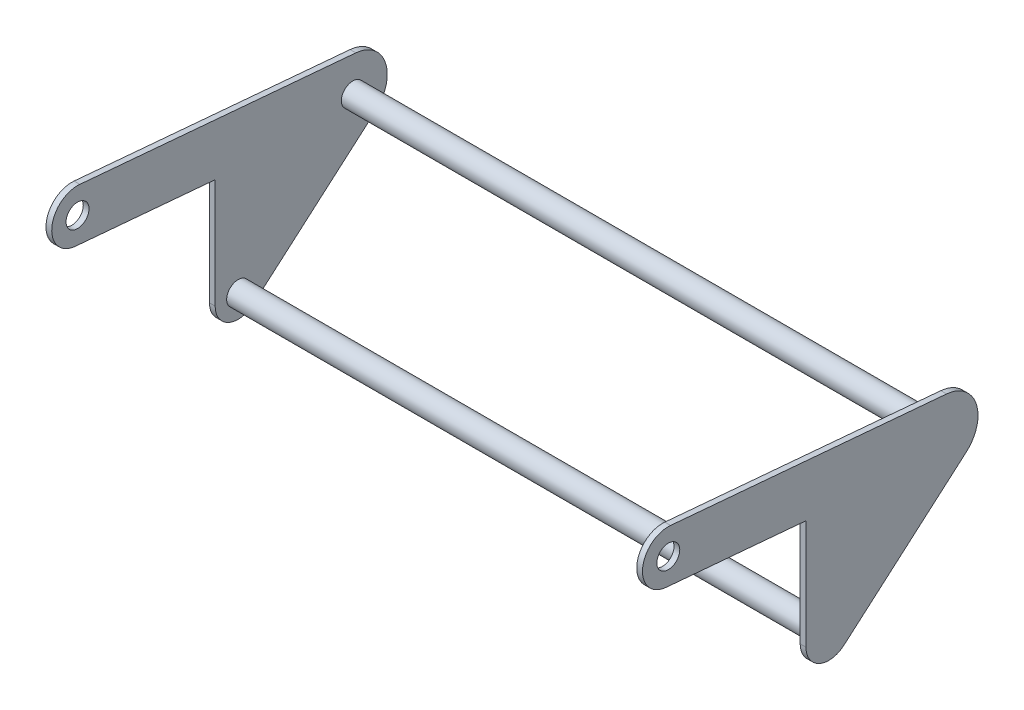
ISO-10303-21;
HEADER;
FILE_DESCRIPTION(('STEP AP214'),'2;1');
FILE_NAME('part.step','',(''),(''),'','','');
FILE_SCHEMA(('AUTOMOTIVE_DESIGN { 1 0 10303 214 1 1 1 1 }'));
ENDSEC;
DATA;
#1=APPLICATION_CONTEXT('core data for automotive mechanical design processes');
#2=APPLICATION_PROTOCOL_DEFINITION('international standard','automotive_design',2000,#1);
#3=PRODUCT_CONTEXT('',#1,'mechanical');
#4=PRODUCT('Part','Part','',(#3));
#5=PRODUCT_RELATED_PRODUCT_CATEGORY('part','',(#4));
#6=PRODUCT_DEFINITION_FORMATION('','',#4);
#7=PRODUCT_DEFINITION_CONTEXT('part definition',#1,'design');
#8=PRODUCT_DEFINITION('design','',#6,#7);
#9=PRODUCT_DEFINITION_SHAPE('','',#8);
#10=(LENGTH_UNIT() NAMED_UNIT(*) SI_UNIT(.MILLI.,.METRE.));
#11=(NAMED_UNIT(*) PLANE_ANGLE_UNIT() SI_UNIT($,.RADIAN.));
#12=(NAMED_UNIT(*) SI_UNIT($,.STERADIAN.) SOLID_ANGLE_UNIT());
#13=UNCERTAINTY_MEASURE_WITH_UNIT(LENGTH_MEASURE(1.E-05),#10,'distance_accuracy_value','');
#14=(GEOMETRIC_REPRESENTATION_CONTEXT(3) GLOBAL_UNCERTAINTY_ASSIGNED_CONTEXT((#13)) GLOBAL_UNIT_ASSIGNED_CONTEXT((#10,
#11,#12)) REPRESENTATION_CONTEXT('',''));
#15=CARTESIAN_POINT('',(0.,0.,0.));
#16=DIRECTION('',(0.,0.,1.));
#17=DIRECTION('',(1.,0.,0.));
#18=AXIS2_PLACEMENT_3D('',#15,#16,#17);
#19=CARTESIAN_POINT('',(660.4,121.210504416149,25.4));
#20=DIRECTION('',(0.,0.,-1.));
#21=DIRECTION('',(0.,1.,0.));
#22=AXIS2_PLACEMENT_3D('',#19,#20,#21);
#23=PLANE('',#22);
#24=DIRECTION('',(-1.,0.,0.));
#25=VECTOR('',#24,1.);
#26=CARTESIAN_POINT('',(660.4,121.210504416149,25.4));
#27=LINE('',#26,#25);
#28=CARTESIAN_POINT('',(660.4,121.210504416149,25.4));
#29=VERTEX_POINT('',#28);
#30=CARTESIAN_POINT('',(654.05,121.210504416149,25.4));
#31=VERTEX_POINT('',#30);
#32=EDGE_CURVE('E250',#29,#31,#27,.T.);
#33=ORIENTED_EDGE('',*,*,#32,.T.);
#34=DIRECTION('',(0.,-1.,0.));
#35=VECTOR('',#34,1.);
#36=CARTESIAN_POINT('',(654.05,121.210504416149,25.4));
#37=LINE('',#36,#35);
#38=CARTESIAN_POINT('',(654.05,0.,25.4));
#39=VERTEX_POINT('',#38);
#40=EDGE_CURVE('E247',#31,#39,#37,.T.);
#41=ORIENTED_EDGE('',*,*,#40,.T.);
#42=DIRECTION('',(-1.,0.,0.));
#43=VECTOR('',#42,1.);
#44=CARTESIAN_POINT('',(660.4,0.,25.4));
#45=LINE('',#44,#43);
#46=CARTESIAN_POINT('',(660.4,0.,25.4));
#47=VERTEX_POINT('',#46);
#48=EDGE_CURVE('E238',#47,#39,#45,.T.);
#49=ORIENTED_EDGE('',*,*,#48,.F.);
#50=DIRECTION('',(0.,-1.,0.));
#51=VECTOR('',#50,1.);
#52=CARTESIAN_POINT('',(660.4,121.210504416149,25.4));
#53=LINE('',#52,#51);
#54=EDGE_CURVE('E226',#29,#47,#53,.T.);
#55=ORIENTED_EDGE('',*,*,#54,.F.);
#56=EDGE_LOOP('',(#33,#41,#49,#55));
#57=FACE_BOUND('',#56,.T.);
#58=ADVANCED_FACE('F49',(#57),#23,.F.);
#59=CARTESIAN_POINT('',(660.4,-19.1855546941757,-16.6455546941757));
#60=DIRECTION('',(0.,0.755336798983294,0.655336798983294));
#61=DIRECTION('',(0.,-0.655336798983294,0.755336798983294));
#62=AXIS2_PLACEMENT_3D('',#59,#60,#61);
#63=PLANE('',#62);
#64=DIRECTION('',(-1.,0.,0.));
#65=VECTOR('',#64,1.);
#66=CARTESIAN_POINT('',(660.4,-19.1855546941757,-16.6455546941757));
#67=LINE('',#66,#65);
#68=CARTESIAN_POINT('',(660.4,-19.1855546941757,-16.6455546941757));
#69=VERTEX_POINT('',#68);
#70=CARTESIAN_POINT('',(654.05,-19.1855546941757,-16.6455546941757));
#71=VERTEX_POINT('',#70);
#72=EDGE_CURVE('E235',#69,#71,#67,.T.);
#73=ORIENTED_EDGE('',*,*,#72,.T.);
#74=DIRECTION('',(0.,0.655336798983294,-0.755336798983294));
#75=VECTOR('',#74,1.);
#76=CARTESIAN_POINT('',(654.05,-19.1855546941757,-16.6455546941757));
#77=LINE('',#76,#75);
#78=CARTESIAN_POINT('',(654.05,98.2216679587365,-151.968332041264));
#79=VERTEX_POINT('',#78);
#80=EDGE_CURVE('E230',#71,#79,#77,.T.);
#81=ORIENTED_EDGE('',*,*,#80,.T.);
#82=DIRECTION('',(-1.,0.,0.));
#83=VECTOR('',#82,1.);
#84=CARTESIAN_POINT('',(660.4,98.2216679587365,-151.968332041264));
#85=LINE('',#84,#83);
#86=CARTESIAN_POINT('',(660.4,98.2216679587365,-151.968332041264));
#87=VERTEX_POINT('',#86);
#88=EDGE_CURVE('E229',#87,#79,#85,.T.);
#89=ORIENTED_EDGE('',*,*,#88,.F.);
#90=DIRECTION('',(0.,0.655336798983294,-0.755336798983294));
#91=VECTOR('',#90,1.);
#92=CARTESIAN_POINT('',(660.4,-19.1855546941757,-16.6455546941757));
#93=LINE('',#92,#91);
#94=EDGE_CURVE('E221',#69,#87,#93,.T.);
#95=ORIENTED_EDGE('',*,*,#94,.F.);
#96=EDGE_LOOP('',(#73,#81,#89,#95));
#97=FACE_BOUND('',#96,.T.);
#98=ADVANCED_FACE('F298',(#97),#63,.F.);
#99=CARTESIAN_POINT('',(660.4,164.955017997296,-130.320633798686));
#100=DIRECTION('',(0.,-0.996194698091746,0.087155742747654));
#101=DIRECTION('',(0.,-0.087155742747654,-0.996194698091746));
#102=AXIS2_PLACEMENT_3D('',#99,#100,#101);
#103=PLANE('',#102);
#104=DIRECTION('',(-1.,0.,0.));
#105=VECTOR('',#104,1.);
#106=CARTESIAN_POINT('',(660.4,164.955017997296,-130.320633798686));
#107=LINE('',#106,#105);
#108=CARTESIAN_POINT('',(660.4,164.955017997296,-130.320633798686));
#109=VERTEX_POINT('',#108);
#110=CARTESIAN_POINT('',(654.05,164.955017997296,-130.320633798686));
#111=VERTEX_POINT('',#110);
#112=EDGE_CURVE('E234',#109,#111,#107,.T.);
#113=ORIENTED_EDGE('',*,*,#112,.T.);
#114=DIRECTION('',(0.,0.087155742747654,0.996194698091746));
#115=VECTOR('',#114,1.);
#116=CARTESIAN_POINT('',(654.05,164.955017997296,-130.320633798686));
#117=LINE('',#116,#115);
#118=CARTESIAN_POINT('',(654.05,191.694192093272,175.309524650986));
#119=VERTEX_POINT('',#118);
#120=EDGE_CURVE('E242',#111,#119,#117,.T.);
#121=ORIENTED_EDGE('',*,*,#120,.T.);
#122=DIRECTION('',(-1.,0.,0.));
#123=VECTOR('',#122,1.);
#124=CARTESIAN_POINT('',(660.4,191.694192093272,175.309524650986));
#125=LINE('',#124,#123);
#126=CARTESIAN_POINT('',(660.4,191.694192093272,175.309524650986));
#127=VERTEX_POINT('',#126);
#128=EDGE_CURVE('E254',#127,#119,#125,.T.);
#129=ORIENTED_EDGE('',*,*,#128,.F.);
#130=DIRECTION('',(0.,0.0871557427476541,0.996194698091746));
#131=VECTOR('',#130,1.);
#132=CARTESIAN_POINT('',(660.4,164.955017997296,-130.320633798686));
#133=LINE('',#132,#131);
#134=EDGE_CURVE('E215',#109,#127,#133,.T.);
#135=ORIENTED_EDGE('',*,*,#134,.F.);
#136=EDGE_LOOP('',(#113,#121,#129,#135));
#137=FACE_BOUND('',#136,.T.);
#138=ADVANCED_FACE('F303',(#137),#103,.F.);
#139=CARTESIAN_POINT('',(660.4,163.227928595301,177.8));
#140=DIRECTION('',(-1.,0.,0.));
#141=DIRECTION('',(0.,0.,1.));
#142=AXIS2_PLACEMENT_3D('',#139,#140,#141);
#143=CYLINDRICAL_SURFACE('',#142,28.575);
#144=CARTESIAN_POINT('',(654.05,163.227928595301,177.8));
#145=DIRECTION('',(1.,0.,0.));
#146=DIRECTION('',(0.,0.,-1.));
#147=AXIS2_PLACEMENT_3D('',#144,#145,#146);
#148=CIRCLE('',#147,28.575);
#149=CARTESIAN_POINT('',(654.05,134.761665097329,180.290475349014));
#150=VERTEX_POINT('',#149);
#151=EDGE_CURVE('E246',#119,#150,#148,.T.);
#152=ORIENTED_EDGE('',*,*,#151,.T.);
#153=DIRECTION('',(-1.,0.,0.));
#154=VECTOR('',#153,1.);
#155=CARTESIAN_POINT('',(660.4,134.761665097329,180.290475349014));
#156=LINE('',#155,#154);
#157=CARTESIAN_POINT('',(660.4,134.761665097329,180.290475349014));
#158=VERTEX_POINT('',#157);
#159=EDGE_CURVE('E211',#158,#150,#156,.T.);
#160=ORIENTED_EDGE('',*,*,#159,.F.);
#161=CARTESIAN_POINT('',(660.4,163.227928595301,177.8));
#162=DIRECTION('',(1.,0.,0.));
#163=DIRECTION('',(0.,0.,-1.));
#164=AXIS2_PLACEMENT_3D('',#161,#162,#163);
#165=CIRCLE('',#164,28.575);
#166=EDGE_CURVE('E59',#127,#158,#165,.T.);
#167=ORIENTED_EDGE('',*,*,#166,.F.);
#168=ORIENTED_EDGE('',*,*,#128,.T.);
#169=EDGE_LOOP('',(#152,#160,#167,#168));
#170=FACE_BOUND('',#169,.T.);
#171=ADVANCED_FACE('F314',(#170),#143,.T.);
#172=CARTESIAN_POINT('',(660.4,134.761665097329,180.290475349014));
#173=DIRECTION('',(0.,0.996194698091746,-0.0871557427476541));
#174=DIRECTION('',(0.,0.0871557427476541,0.996194698091746));
#175=AXIS2_PLACEMENT_3D('',#172,#173,#174);
#176=PLANE('',#175);
#177=ORIENTED_EDGE('',*,*,#159,.T.);
#178=DIRECTION('',(0.,-0.0871557427476541,-0.996194698091746));
#179=VECTOR('',#178,1.);
#180=CARTESIAN_POINT('',(654.05,134.761665097329,180.290475349014));
#181=LINE('',#180,#179);
#182=EDGE_CURVE('E208',#150,#31,#181,.T.);
#183=ORIENTED_EDGE('',*,*,#182,.T.);
#184=ORIENTED_EDGE('',*,*,#32,.F.);
#185=DIRECTION('',(0.,-0.0871557427476541,-0.996194698091746));
#186=VECTOR('',#185,1.);
#187=CARTESIAN_POINT('',(660.4,134.761665097329,180.290475349014));
#188=LINE('',#187,#186);
#189=EDGE_CURVE('E11',#158,#29,#188,.T.);
#190=ORIENTED_EDGE('',*,*,#189,.F.);
#191=EDGE_LOOP('',(#177,#183,#184,#190));
#192=FACE_BOUND('',#191,.T.);
#193=ADVANCED_FACE('F309',(#192),#176,.F.);
#194=CARTESIAN_POINT('',(660.4,0.,0.));
#195=DIRECTION('',(-1.,0.,0.));
#196=DIRECTION('',(0.,0.,1.));
#197=AXIS2_PLACEMENT_3D('',#194,#195,#196);
#198=CYLINDRICAL_SURFACE('',#197,25.4);
#199=CARTESIAN_POINT('',(654.05,0.,0.));
#200=DIRECTION('',(1.,0.,0.));
#201=DIRECTION('',(0.,0.,-1.));
#202=AXIS2_PLACEMENT_3D('',#199,#200,#201);
#203=CIRCLE('',#202,25.4);
#204=EDGE_CURVE('E68',#39,#71,#203,.T.);
#205=ORIENTED_EDGE('',*,*,#204,.T.);
#206=ORIENTED_EDGE('',*,*,#72,.F.);
#207=CARTESIAN_POINT('',(660.4,0.,0.));
#208=DIRECTION('',(1.,0.,0.));
#209=DIRECTION('',(0.,0.,-1.));
#210=AXIS2_PLACEMENT_3D('',#207,#208,#209);
#211=CIRCLE('',#210,25.4);
#212=EDGE_CURVE('E110',#47,#69,#211,.T.);
#213=ORIENTED_EDGE('',*,*,#212,.F.);
#214=ORIENTED_EDGE('',*,*,#48,.T.);
#215=EDGE_LOOP('',(#205,#206,#213,#214));
#216=FACE_BOUND('',#215,.T.);
#217=ADVANCED_FACE('F325',(#216),#198,.T.);
#218=CARTESIAN_POINT('',(660.4,127.,-127.));
#219=DIRECTION('',(-1.,0.,0.));
#220=DIRECTION('',(0.,0.,1.));
#221=AXIS2_PLACEMENT_3D('',#218,#219,#220);
#222=CYLINDRICAL_SURFACE('',#221,38.1);
#223=CARTESIAN_POINT('',(654.05,127.,-127.));
#224=DIRECTION('',(1.,0.,0.));
#225=DIRECTION('',(0.,0.,-1.));
#226=AXIS2_PLACEMENT_3D('',#223,#224,#225);
#227=CIRCLE('',#226,38.1);
#228=EDGE_CURVE('E239',#79,#111,#227,.T.);
#229=ORIENTED_EDGE('',*,*,#228,.T.);
#230=ORIENTED_EDGE('',*,*,#112,.F.);
#231=CARTESIAN_POINT('',(660.4,127.,-127.));
#232=DIRECTION('',(1.,0.,0.));
#233=DIRECTION('',(0.,0.,-1.));
#234=AXIS2_PLACEMENT_3D('',#231,#232,#233);
#235=CIRCLE('',#234,38.1);
#236=EDGE_CURVE('E218',#87,#109,#235,.T.);
#237=ORIENTED_EDGE('',*,*,#236,.F.);
#238=ORIENTED_EDGE('',*,*,#88,.T.);
#239=EDGE_LOOP('',(#229,#230,#237,#238));
#240=FACE_BOUND('',#239,.T.);
#241=ADVANCED_FACE('F324',(#240),#222,.T.);
#242=CARTESIAN_POINT('',(660.4,0.,0.));
#243=DIRECTION('',(1.,0.,0.));
#244=DIRECTION('',(0.,0.,-1.));
#245=AXIS2_PLACEMENT_3D('',#242,#243,#244);
#246=PLANE('',#245);
#247=CARTESIAN_POINT('',(660.4,163.227928595301,177.8));
#248=DIRECTION('',(1.,0.,0.));
#249=DIRECTION('',(0.,0.,-1.));
#250=AXIS2_PLACEMENT_3D('',#247,#248,#249);
#251=CIRCLE('',#250,12.7);
#252=CARTESIAN_POINT('',(660.4,163.227928595301,165.1));
#253=VERTEX_POINT('',#252);
#254=EDGE_CURVE('E344',#253,#253,#251,.T.);
#255=ORIENTED_EDGE('',*,*,#254,.F.);
#256=EDGE_LOOP('',(#255));
#257=FACE_BOUND('',#256,.T.);
#258=ORIENTED_EDGE('',*,*,#54,.T.);
#259=ORIENTED_EDGE('',*,*,#212,.T.);
#260=ORIENTED_EDGE('',*,*,#94,.T.);
#261=ORIENTED_EDGE('',*,*,#236,.T.);
#262=ORIENTED_EDGE('',*,*,#134,.T.);
#263=ORIENTED_EDGE('',*,*,#166,.T.);
#264=ORIENTED_EDGE('',*,*,#189,.T.);
#265=EDGE_LOOP('',(#258,#259,#260,#261,#262,#263,#264));
#266=FACE_BOUND('',#265,.T.);
#267=ADVANCED_FACE('F292',(#257,#266),#246,.T.);
#268=CARTESIAN_POINT('',(654.05,-25.4,-165.1));
#269=DIRECTION('',(1.,0.,0.));
#270=DIRECTION('',(0.,0.,-1.));
#271=AXIS2_PLACEMENT_3D('',#268,#269,#270);
#272=PLANE('',#271);
#273=CARTESIAN_POINT('',(654.05,163.227928595301,177.8));
#274=DIRECTION('',(1.,0.,0.));
#275=DIRECTION('',(0.,0.,-1.));
#276=AXIS2_PLACEMENT_3D('',#273,#274,#275);
#277=CIRCLE('',#276,12.7);
#278=CARTESIAN_POINT('',(654.05,163.227928595301,165.1));
#279=VERTEX_POINT('',#278);
#280=EDGE_CURVE('E348',#279,#279,#277,.T.);
#281=ORIENTED_EDGE('',*,*,#280,.T.);
#282=EDGE_LOOP('',(#281));
#283=FACE_BOUND('',#282,.T.);
#284=CARTESIAN_POINT('',(654.05,0.,0.));
#285=DIRECTION('',(1.,0.,0.));
#286=DIRECTION('',(0.,0.,-1.));
#287=AXIS2_PLACEMENT_3D('',#284,#285,#286);
#288=CIRCLE('',#287,12.7);
#289=CARTESIAN_POINT('',(654.05,0.,-12.7));
#290=VERTEX_POINT('',#289);
#291=EDGE_CURVE('E353',#290,#290,#288,.T.);
#292=ORIENTED_EDGE('',*,*,#291,.T.);
#293=EDGE_LOOP('',(#292));
#294=FACE_BOUND('',#293,.T.);
#295=CARTESIAN_POINT('',(654.05,127.,-127.));
#296=DIRECTION('',(1.,0.,0.));
#297=DIRECTION('',(0.,0.,-1.));
#298=AXIS2_PLACEMENT_3D('',#295,#296,#297);
#299=CIRCLE('',#298,12.7);
#300=CARTESIAN_POINT('',(654.05,127.,-139.7));
#301=VERTEX_POINT('',#300);
#302=EDGE_CURVE('E207',#301,#301,#299,.T.);
#303=ORIENTED_EDGE('',*,*,#302,.T.);
#304=EDGE_LOOP('',(#303));
#305=FACE_BOUND('',#304,.T.);
#306=ORIENTED_EDGE('',*,*,#80,.F.);
#307=ORIENTED_EDGE('',*,*,#204,.F.);
#308=ORIENTED_EDGE('',*,*,#40,.F.);
#309=ORIENTED_EDGE('',*,*,#182,.F.);
#310=ORIENTED_EDGE('',*,*,#151,.F.);
#311=ORIENTED_EDGE('',*,*,#120,.F.);
#312=ORIENTED_EDGE('',*,*,#228,.F.);
#313=EDGE_LOOP('',(#306,#307,#308,#309,#310,#311,#312));
#314=FACE_BOUND('',#313,.T.);
#315=ADVANCED_FACE('F278',(#283,#294,#305,#314),#272,.F.);
#316=CARTESIAN_POINT('',(-0.00199999999994649,127.,-127.));
#317=DIRECTION('',(1.,0.,0.));
#318=DIRECTION('',(0.,0.,-1.));
#319=AXIS2_PLACEMENT_3D('',#316,#317,#318);
#320=CYLINDRICAL_SURFACE('',#319,12.7);
#321=CARTESIAN_POINT('',(6.35,127.,-127.));
#322=DIRECTION('',(-1.,0.,0.));
#323=DIRECTION('',(0.,0.,1.));
#324=AXIS2_PLACEMENT_3D('',#321,#322,#323);
#325=CIRCLE('',#324,12.7);
#326=CARTESIAN_POINT('',(6.35000000000001,127.,-114.3));
#327=VERTEX_POINT('',#326);
#328=EDGE_CURVE('E165',#327,#327,#325,.F.);
#329=ORIENTED_EDGE('',*,*,#328,.T.);
#330=EDGE_LOOP('',(#329));
#331=FACE_BOUND('',#330,.T.);
#332=ORIENTED_EDGE('',*,*,#302,.F.);
#333=EDGE_LOOP('',(#332));
#334=FACE_BOUND('',#333,.T.);
#335=ADVANCED_FACE('F280',(#331,#334),#320,.T.);
#336=CARTESIAN_POINT('',(0.,0.,0.));
#337=DIRECTION('',(1.,0.,0.));
#338=DIRECTION('',(0.,0.,-1.));
#339=AXIS2_PLACEMENT_3D('',#336,#337,#338);
#340=PLANE('',#339);
#341=CARTESIAN_POINT('',(0.,163.227928595301,177.8));
#342=DIRECTION('',(1.,0.,0.));
#343=DIRECTION('',(0.,0.,-1.));
#344=AXIS2_PLACEMENT_3D('',#341,#342,#343);
#345=CIRCLE('',#344,12.7);
#346=CARTESIAN_POINT('',(0.,163.227928595301,165.1));
#347=VERTEX_POINT('',#346);
#348=EDGE_CURVE('E522',#347,#347,#345,.T.);
#349=ORIENTED_EDGE('',*,*,#348,.T.);
#350=EDGE_LOOP('',(#349));
#351=FACE_BOUND('',#350,.T.);
#352=DIRECTION('',(0.,-1.,0.));
#353=VECTOR('',#352,1.);
#354=CARTESIAN_POINT('',(0.,121.210504416149,25.4));
#355=LINE('',#354,#353);
#356=CARTESIAN_POINT('',(0.,121.210504416149,25.4));
#357=VERTEX_POINT('',#356);
#358=CARTESIAN_POINT('',(0.,0.,25.4));
#359=VERTEX_POINT('',#358);
#360=EDGE_CURVE('E377',#357,#359,#355,.T.);
#361=ORIENTED_EDGE('',*,*,#360,.F.);
#362=DIRECTION('',(0.,-0.0871557427476541,-0.996194698091746));
#363=VECTOR('',#362,1.);
#364=CARTESIAN_POINT('',(0.,134.761665097329,180.290475349014));
#365=LINE('',#364,#363);
#366=CARTESIAN_POINT('',(0.,134.761665097329,180.290475349014));
#367=VERTEX_POINT('',#366);
#368=EDGE_CURVE('E178',#367,#357,#365,.T.);
#369=ORIENTED_EDGE('',*,*,#368,.F.);
#370=CARTESIAN_POINT('',(0.,163.227928595301,177.8));
#371=DIRECTION('',(1.,0.,0.));
#372=DIRECTION('',(0.,0.,-1.));
#373=AXIS2_PLACEMENT_3D('',#370,#371,#372);
#374=CIRCLE('',#373,28.575);
#375=CARTESIAN_POINT('',(0.,191.694192093272,175.309524650986));
#376=VERTEX_POINT('',#375);
#377=EDGE_CURVE('E187',#376,#367,#374,.T.);
#378=ORIENTED_EDGE('',*,*,#377,.F.);
#379=DIRECTION('',(0.,0.0871557427476541,0.996194698091746));
#380=VECTOR('',#379,1.);
#381=CARTESIAN_POINT('',(0.,164.955017997296,-130.320633798686));
#382=LINE('',#381,#380);
#383=CARTESIAN_POINT('',(0.,164.955017997296,-130.320633798686));
#384=VERTEX_POINT('',#383);
#385=EDGE_CURVE('E392',#384,#376,#382,.T.);
#386=ORIENTED_EDGE('',*,*,#385,.F.);
#387=CARTESIAN_POINT('',(0.,127.,-127.));
#388=DIRECTION('',(1.,0.,0.));
#389=DIRECTION('',(0.,0.,-1.));
#390=AXIS2_PLACEMENT_3D('',#387,#388,#389);
#391=CIRCLE('',#390,38.1);
#392=CARTESIAN_POINT('',(0.,98.2216679587365,-151.968332041264));
#393=VERTEX_POINT('',#392);
#394=EDGE_CURVE('E388',#393,#384,#391,.T.);
#395=ORIENTED_EDGE('',*,*,#394,.F.);
#396=DIRECTION('',(0.,0.655336798983294,-0.755336798983294));
#397=VECTOR('',#396,1.);
#398=CARTESIAN_POINT('',(0.,-19.1855546941757,-16.6455546941757));
#399=LINE('',#398,#397);
#400=CARTESIAN_POINT('',(0.,-19.1855546941757,-16.6455546941757));
#401=VERTEX_POINT('',#400);
#402=EDGE_CURVE('E384',#401,#393,#399,.T.);
#403=ORIENTED_EDGE('',*,*,#402,.F.);
#404=CARTESIAN_POINT('',(0.,0.,0.));
#405=DIRECTION('',(1.,0.,0.));
#406=DIRECTION('',(0.,0.,-1.));
#407=AXIS2_PLACEMENT_3D('',#404,#405,#406);
#408=CIRCLE('',#407,25.4);
#409=EDGE_CURVE('E380',#359,#401,#408,.T.);
#410=ORIENTED_EDGE('',*,*,#409,.F.);
#411=EDGE_LOOP('',(#361,#369,#378,#386,#395,#403,#410));
#412=FACE_BOUND('',#411,.T.);
#413=ADVANCED_FACE('F282',(#351,#412),#340,.F.);
#414=CARTESIAN_POINT('',(660.4,134.761665097329,180.290475349014));
#415=DIRECTION('',(0.,0.996194698091746,-0.0871557427476541));
#416=DIRECTION('',(0.,0.0871557427476541,0.996194698091746));
#417=AXIS2_PLACEMENT_3D('',#414,#415,#416);
#418=PLANE('',#417);
#419=DIRECTION('',(-1.,0.,0.));
#420=VECTOR('',#419,1.);
#421=CARTESIAN_POINT('',(660.4,121.210504416149,25.4));
#422=LINE('',#421,#420);
#423=CARTESIAN_POINT('',(6.34999999999995,121.210504416149,25.4));
#424=VERTEX_POINT('',#423);
#425=EDGE_CURVE('E171',#424,#357,#422,.T.);
#426=ORIENTED_EDGE('',*,*,#425,.F.);
#427=DIRECTION('',(0.,0.0871557427476541,0.996194698091746));
#428=VECTOR('',#427,1.);
#429=CARTESIAN_POINT('',(6.34999999999997,134.761665097329,180.290475349014));
#430=LINE('',#429,#428);
#431=CARTESIAN_POINT('',(6.34999999999997,134.761665097329,180.290475349014));
#432=VERTEX_POINT('',#431);
#433=EDGE_CURVE('E156',#424,#432,#430,.T.);
#434=ORIENTED_EDGE('',*,*,#433,.T.);
#435=DIRECTION('',(-1.,0.,0.));
#436=VECTOR('',#435,1.);
#437=CARTESIAN_POINT('',(660.4,134.761665097329,180.290475349014));
#438=LINE('',#437,#436);
#439=EDGE_CURVE('E181',#432,#367,#438,.T.);
#440=ORIENTED_EDGE('',*,*,#439,.T.);
#441=ORIENTED_EDGE('',*,*,#368,.T.);
#442=EDGE_LOOP('',(#426,#434,#440,#441));
#443=FACE_BOUND('',#442,.T.);
#444=ADVANCED_FACE('F176',(#443),#418,.F.);
#445=CARTESIAN_POINT('',(660.4,163.227928595301,177.8));
#446=DIRECTION('',(-1.,0.,0.));
#447=DIRECTION('',(0.,0.,1.));
#448=AXIS2_PLACEMENT_3D('',#445,#446,#447);
#449=CYLINDRICAL_SURFACE('',#448,28.575);
#450=CARTESIAN_POINT('',(6.34999999999997,163.227928595301,177.8));
#451=DIRECTION('',(-1.,0.,0.));
#452=DIRECTION('',(0.,0.,1.));
#453=AXIS2_PLACEMENT_3D('',#450,#451,#452);
#454=CIRCLE('',#453,28.575);
#455=CARTESIAN_POINT('',(6.34999999999997,191.694192093272,175.309524650986));
#456=VERTEX_POINT('',#455);
#457=EDGE_CURVE('E117',#432,#456,#454,.T.);
#458=ORIENTED_EDGE('',*,*,#457,.T.);
#459=DIRECTION('',(-1.,0.,0.));
#460=VECTOR('',#459,1.);
#461=CARTESIAN_POINT('',(660.4,191.694192093272,175.309524650986));
#462=LINE('',#461,#460);
#463=EDGE_CURVE('E185',#456,#376,#462,.T.);
#464=ORIENTED_EDGE('',*,*,#463,.T.);
#465=ORIENTED_EDGE('',*,*,#377,.T.);
#466=ORIENTED_EDGE('',*,*,#439,.F.);
#467=EDGE_LOOP('',(#458,#464,#465,#466));
#468=FACE_BOUND('',#467,.T.);
#469=ADVANCED_FACE('F399',(#468),#449,.T.);
#470=CARTESIAN_POINT('',(660.4,164.955017997296,-130.320633798686));
#471=DIRECTION('',(0.,-0.996194698091746,0.087155742747654));
#472=DIRECTION('',(0.,-0.087155742747654,-0.996194698091746));
#473=AXIS2_PLACEMENT_3D('',#470,#471,#472);
#474=PLANE('',#473);
#475=ORIENTED_EDGE('',*,*,#463,.F.);
#476=DIRECTION('',(0.,-0.087155742747654,-0.996194698091746));
#477=VECTOR('',#476,1.);
#478=CARTESIAN_POINT('',(6.34999999999997,164.955017997296,-130.320633798686));
#479=LINE('',#478,#477);
#480=CARTESIAN_POINT('',(6.34999999999997,164.955017997296,-130.320633798686));
#481=VERTEX_POINT('',#480);
#482=EDGE_CURVE('E174',#456,#481,#479,.T.);
#483=ORIENTED_EDGE('',*,*,#482,.T.);
#484=DIRECTION('',(-1.,0.,0.));
#485=VECTOR('',#484,1.);
#486=CARTESIAN_POINT('',(660.4,164.955017997296,-130.320633798686));
#487=LINE('',#486,#485);
#488=EDGE_CURVE('E193',#481,#384,#487,.T.);
#489=ORIENTED_EDGE('',*,*,#488,.T.);
#490=ORIENTED_EDGE('',*,*,#385,.T.);
#491=EDGE_LOOP('',(#475,#483,#489,#490));
#492=FACE_BOUND('',#491,.T.);
#493=ADVANCED_FACE('F417',(#492),#474,.F.);
#494=CARTESIAN_POINT('',(660.4,127.,-127.));
#495=DIRECTION('',(-1.,0.,0.));
#496=DIRECTION('',(0.,0.,1.));
#497=AXIS2_PLACEMENT_3D('',#494,#495,#496);
#498=CYLINDRICAL_SURFACE('',#497,38.1);
#499=CARTESIAN_POINT('',(6.34999999999997,127.,-127.));
#500=DIRECTION('',(-1.,0.,0.));
#501=DIRECTION('',(0.,0.,1.));
#502=AXIS2_PLACEMENT_3D('',#499,#500,#501);
#503=CIRCLE('',#502,38.1);
#504=CARTESIAN_POINT('',(6.34999999999996,98.2216679587365,-151.968332041264));
#505=VERTEX_POINT('',#504);
#506=EDGE_CURVE('E367',#481,#505,#503,.T.);
#507=ORIENTED_EDGE('',*,*,#506,.T.);
#508=DIRECTION('',(-1.,0.,0.));
#509=VECTOR('',#508,1.);
#510=CARTESIAN_POINT('',(660.4,98.2216679587365,-151.968332041264));
#511=LINE('',#510,#509);
#512=EDGE_CURVE('E196',#505,#393,#511,.T.);
#513=ORIENTED_EDGE('',*,*,#512,.T.);
#514=ORIENTED_EDGE('',*,*,#394,.T.);
#515=ORIENTED_EDGE('',*,*,#488,.F.);
#516=EDGE_LOOP('',(#507,#513,#514,#515));
#517=FACE_BOUND('',#516,.T.);
#518=ADVANCED_FACE('F414',(#517),#498,.T.);
#519=CARTESIAN_POINT('',(660.4,-19.1855546941757,-16.6455546941757));
#520=DIRECTION('',(0.,0.755336798983294,0.655336798983294));
#521=DIRECTION('',(0.,-0.655336798983294,0.755336798983294));
#522=AXIS2_PLACEMENT_3D('',#519,#520,#521);
#523=PLANE('',#522);
#524=ORIENTED_EDGE('',*,*,#512,.F.);
#525=DIRECTION('',(0.,-0.655336798983294,0.755336798983294));
#526=VECTOR('',#525,1.);
#527=CARTESIAN_POINT('',(6.34999999999997,-19.1855546941757,-16.6455546941756));
#528=LINE('',#527,#526);
#529=CARTESIAN_POINT('',(6.34999999999997,-19.1855546941757,-16.6455546941757));
#530=VERTEX_POINT('',#529);
#531=EDGE_CURVE('E370',#505,#530,#528,.T.);
#532=ORIENTED_EDGE('',*,*,#531,.T.);
#533=DIRECTION('',(-1.,0.,0.));
#534=VECTOR('',#533,1.);
#535=CARTESIAN_POINT('',(660.4,-19.1855546941757,-16.6455546941757));
#536=LINE('',#535,#534);
#537=EDGE_CURVE('E199',#530,#401,#536,.T.);
#538=ORIENTED_EDGE('',*,*,#537,.T.);
#539=ORIENTED_EDGE('',*,*,#402,.T.);
#540=EDGE_LOOP('',(#524,#532,#538,#539));
#541=FACE_BOUND('',#540,.T.);
#542=ADVANCED_FACE('F412',(#541),#523,.F.);
#543=CARTESIAN_POINT('',(660.4,0.,0.));
#544=DIRECTION('',(-1.,0.,0.));
#545=DIRECTION('',(0.,0.,1.));
#546=AXIS2_PLACEMENT_3D('',#543,#544,#545);
#547=CYLINDRICAL_SURFACE('',#546,25.4);
#548=CARTESIAN_POINT('',(6.34999999999997,0.,0.));
#549=DIRECTION('',(-1.,0.,0.));
#550=DIRECTION('',(0.,0.,1.));
#551=AXIS2_PLACEMENT_3D('',#548,#549,#550);
#552=CIRCLE('',#551,25.4);
#553=CARTESIAN_POINT('',(6.34999999999997,0.,25.4));
#554=VERTEX_POINT('',#553);
#555=EDGE_CURVE('E374',#530,#554,#552,.T.);
#556=ORIENTED_EDGE('',*,*,#555,.T.);
#557=DIRECTION('',(-1.,0.,0.));
#558=VECTOR('',#557,1.);
#559=CARTESIAN_POINT('',(660.4,0.,25.4));
#560=LINE('',#559,#558);
#561=EDGE_CURVE('E166',#554,#359,#560,.T.);
#562=ORIENTED_EDGE('',*,*,#561,.T.);
#563=ORIENTED_EDGE('',*,*,#409,.T.);
#564=ORIENTED_EDGE('',*,*,#537,.F.);
#565=EDGE_LOOP('',(#556,#562,#563,#564));
#566=FACE_BOUND('',#565,.T.);
#567=ADVANCED_FACE('F408',(#566),#547,.T.);
#568=CARTESIAN_POINT('',(660.4,121.210504416149,25.4));
#569=DIRECTION('',(0.,0.,-1.));
#570=DIRECTION('',(0.,1.,0.));
#571=AXIS2_PLACEMENT_3D('',#568,#569,#570);
#572=PLANE('',#571);
#573=ORIENTED_EDGE('',*,*,#561,.F.);
#574=DIRECTION('',(0.,1.,0.));
#575=VECTOR('',#574,1.);
#576=CARTESIAN_POINT('',(6.34999999999997,121.210504416149,25.4));
#577=LINE('',#576,#575);
#578=EDGE_CURVE('E159',#554,#424,#577,.T.);
#579=ORIENTED_EDGE('',*,*,#578,.T.);
#580=ORIENTED_EDGE('',*,*,#425,.T.);
#581=ORIENTED_EDGE('',*,*,#360,.T.);
#582=EDGE_LOOP('',(#573,#579,#580,#581));
#583=FACE_BOUND('',#582,.T.);
#584=ADVANCED_FACE('F169',(#583),#572,.F.);
#585=CARTESIAN_POINT('',(6.35,-25.4,-165.1));
#586=DIRECTION('',(-1.,0.,0.));
#587=DIRECTION('',(0.,0.,1.));
#588=AXIS2_PLACEMENT_3D('',#585,#586,#587);
#589=PLANE('',#588);
#590=CARTESIAN_POINT('',(6.35000000000004,163.227928595301,177.8));
#591=DIRECTION('',(-1.,0.,0.));
#592=DIRECTION('',(0.,0.,1.));
#593=AXIS2_PLACEMENT_3D('',#590,#591,#592);
#594=CIRCLE('',#593,12.7);
#595=CARTESIAN_POINT('',(6.35000000000004,163.227928595301,190.5));
#596=VERTEX_POINT('',#595);
#597=EDGE_CURVE('E52',#596,#596,#594,.T.);
#598=ORIENTED_EDGE('',*,*,#597,.T.);
#599=EDGE_LOOP('',(#598));
#600=FACE_BOUND('',#599,.T.);
#601=CARTESIAN_POINT('',(6.35000000000002,0.,0.));
#602=DIRECTION('',(-1.,0.,0.));
#603=DIRECTION('',(0.,0.,1.));
#604=AXIS2_PLACEMENT_3D('',#601,#602,#603);
#605=CIRCLE('',#604,12.7);
#606=CARTESIAN_POINT('',(6.35000000000002,0.,12.7));
#607=VERTEX_POINT('',#606);
#608=EDGE_CURVE('E347',#607,#607,#605,.F.);
#609=ORIENTED_EDGE('',*,*,#608,.F.);
#610=EDGE_LOOP('',(#609));
#611=FACE_BOUND('',#610,.T.);
#612=ORIENTED_EDGE('',*,*,#328,.F.);
#613=EDGE_LOOP('',(#612));
#614=FACE_BOUND('',#613,.T.);
#615=ORIENTED_EDGE('',*,*,#555,.F.);
#616=ORIENTED_EDGE('',*,*,#531,.F.);
#617=ORIENTED_EDGE('',*,*,#506,.F.);
#618=ORIENTED_EDGE('',*,*,#482,.F.);
#619=ORIENTED_EDGE('',*,*,#457,.F.);
#620=ORIENTED_EDGE('',*,*,#433,.F.);
#621=ORIENTED_EDGE('',*,*,#578,.F.);
#622=EDGE_LOOP('',(#615,#616,#617,#618,#619,#620,#621));
#623=FACE_BOUND('',#622,.T.);
#624=ADVANCED_FACE('F158',(#600,#611,#614,#623),#589,.F.);
#625=CARTESIAN_POINT('',(-0.00199999999994649,0.,0.));
#626=DIRECTION('',(1.,0.,0.));
#627=DIRECTION('',(0.,0.,-1.));
#628=AXIS2_PLACEMENT_3D('',#625,#626,#627);
#629=CYLINDRICAL_SURFACE('',#628,12.7);
#630=ORIENTED_EDGE('',*,*,#608,.T.);
#631=EDGE_LOOP('',(#630));
#632=FACE_BOUND('',#631,.T.);
#633=ORIENTED_EDGE('',*,*,#291,.F.);
#634=EDGE_LOOP('',(#633));
#635=FACE_BOUND('',#634,.T.);
#636=ADVANCED_FACE('F435',(#632,#635),#629,.T.);
#637=CARTESIAN_POINT('',(0.,163.227928595301,177.8));
#638=DIRECTION('',(1.,0.,0.));
#639=DIRECTION('',(0.,0.,-1.));
#640=AXIS2_PLACEMENT_3D('',#637,#638,#639);
#641=CYLINDRICAL_SURFACE('',#640,12.7);
#642=ORIENTED_EDGE('',*,*,#348,.F.);
#643=EDGE_LOOP('',(#642));
#644=FACE_BOUND('',#643,.T.);
#645=ORIENTED_EDGE('',*,*,#597,.F.);
#646=EDGE_LOOP('',(#645));
#647=FACE_BOUND('',#646,.T.);
#648=ADVANCED_FACE('F441',(#644,#647),#641,.F.);
#649=ORIENTED_EDGE('',*,*,#254,.T.);
#650=EDGE_LOOP('',(#649));
#651=FACE_BOUND('',#650,.T.);
#652=ORIENTED_EDGE('',*,*,#280,.F.);
#653=EDGE_LOOP('',(#652));
#654=FACE_BOUND('',#653,.T.);
#655=ADVANCED_FACE('F503',(#651,#654),#641,.F.);
#656=CLOSED_SHELL('',(#58,#98,#138,#171,#193,#217,#241,#267,#315,#335,#413,#444,#469,#493,#518,
#542,#567,#584,#624,#636,#648,#655));
#657=MANIFOLD_SOLID_BREP('B2',#656);
#658=ADVANCED_BREP_SHAPE_REPRESENTATION('',(#18,#657),#14);
#659=SHAPE_DEFINITION_REPRESENTATION(#9,#658);
ENDSEC;
END-ISO-10303-21;
